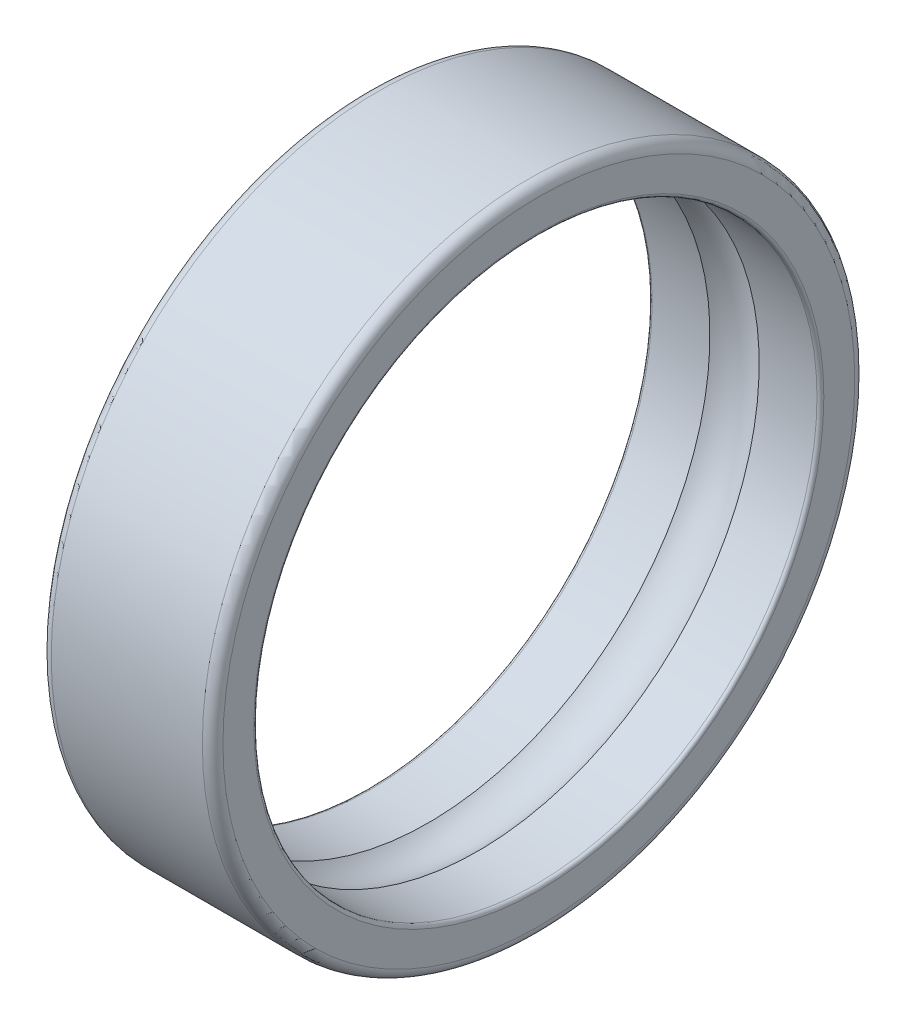
ISO-10303-21;
HEADER;
FILE_DESCRIPTION(('STEP AP214'),'2;1');
FILE_NAME('part.step','',(''),(''),'','','');
FILE_SCHEMA(('AUTOMOTIVE_DESIGN { 1 0 10303 214 1 1 1 1 }'));
ENDSEC;
DATA;
#1=APPLICATION_CONTEXT('core data for automotive mechanical design processes');
#2=APPLICATION_PROTOCOL_DEFINITION('international standard','automotive_design',2000,#1);
#3=PRODUCT_CONTEXT('',#1,'mechanical');
#4=PRODUCT('Part','Part','',(#3));
#5=PRODUCT_RELATED_PRODUCT_CATEGORY('part','',(#4));
#6=PRODUCT_DEFINITION_FORMATION('','',#4);
#7=PRODUCT_DEFINITION_CONTEXT('part definition',#1,'design');
#8=PRODUCT_DEFINITION('design','',#6,#7);
#9=PRODUCT_DEFINITION_SHAPE('','',#8);
#10=(LENGTH_UNIT() NAMED_UNIT(*) SI_UNIT(.MILLI.,.METRE.));
#11=(NAMED_UNIT(*) PLANE_ANGLE_UNIT() SI_UNIT($,.RADIAN.));
#12=(NAMED_UNIT(*) SI_UNIT($,.STERADIAN.) SOLID_ANGLE_UNIT());
#13=UNCERTAINTY_MEASURE_WITH_UNIT(LENGTH_MEASURE(1.E-05),#10,'distance_accuracy_value','');
#14=(GEOMETRIC_REPRESENTATION_CONTEXT(3) GLOBAL_UNCERTAINTY_ASSIGNED_CONTEXT((#13)) GLOBAL_UNIT_ASSIGNED_CONTEXT((#10,
#11,#12)) REPRESENTATION_CONTEXT('',''));
#15=CARTESIAN_POINT('',(0.,0.,0.));
#16=DIRECTION('',(0.,0.,1.));
#17=DIRECTION('',(1.,0.,0.));
#18=AXIS2_PLACEMENT_3D('',#15,#16,#17);
#19=CARTESIAN_POINT('',(0.,0.,0.));
#20=DIRECTION('',(1.,0.,0.));
#21=DIRECTION('',(0.,0.,-1.));
#22=AXIS2_PLACEMENT_3D('',#19,#20,#21);
#23=TOROIDAL_SURFACE('',#22,7.25,1.1905);
#24=CARTESIAN_POINT('',(0.717488850087582,0.,0.));
#25=DIRECTION('',(-1.,0.,0.));
#26=DIRECTION('',(0.,0.,1.));
#27=AXIS2_PLACEMENT_3D('',#24,#25,#26);
#28=CIRCLE('',#27,8.2);
#29=CARTESIAN_POINT('',(0.717488850087582,0.,8.2));
#30=VERTEX_POINT('',#29);
#31=EDGE_CURVE('E142',#30,#30,#28,.F.);
#32=ORIENTED_EDGE('',*,*,#31,.T.);
#33=EDGE_LOOP('',(#32));
#34=FACE_BOUND('',#33,.T.);
#35=CARTESIAN_POINT('',(-0.717488850087582,0.,0.));
#36=DIRECTION('',(-1.,0.,0.));
#37=DIRECTION('',(0.,0.,1.));
#38=AXIS2_PLACEMENT_3D('',#35,#36,#37);
#39=CIRCLE('',#38,8.2);
#40=CARTESIAN_POINT('',(-0.717488850087582,0.,8.2));
#41=VERTEX_POINT('',#40);
#42=EDGE_CURVE('E135',#41,#41,#39,.T.);
#43=ORIENTED_EDGE('',*,*,#42,.T.);
#44=EDGE_LOOP('',(#43));
#45=FACE_BOUND('',#44,.T.);
#46=ADVANCED_FACE('F14',(#34,#45),#23,.F.);
#47=CARTESIAN_POINT('',(2.5,0.,0.));
#48=DIRECTION('',(-1.,0.,0.));
#49=DIRECTION('',(0.,0.,1.));
#50=AXIS2_PLACEMENT_3D('',#47,#48,#49);
#51=CYLINDRICAL_SURFACE('',#50,8.2);
#52=ORIENTED_EDGE('',*,*,#31,.F.);
#53=EDGE_LOOP('',(#52));
#54=FACE_BOUND('',#53,.T.);
#55=CARTESIAN_POINT('',(2.4,0.,0.));
#56=DIRECTION('',(1.,0.,0.));
#57=DIRECTION('',(0.,0.,-1.));
#58=AXIS2_PLACEMENT_3D('',#55,#56,#57);
#59=CIRCLE('',#58,8.2);
#60=CARTESIAN_POINT('',(2.4,0.,-8.2));
#61=VERTEX_POINT('',#60);
#62=EDGE_CURVE('E107',#61,#61,#59,.F.);
#63=ORIENTED_EDGE('',*,*,#62,.F.);
#64=EDGE_LOOP('',(#63));
#65=FACE_BOUND('',#64,.T.);
#66=ADVANCED_FACE('F148',(#54,#65),#51,.F.);
#67=CARTESIAN_POINT('',(2.5,0.,0.));
#68=DIRECTION('',(-1.,0.,0.));
#69=DIRECTION('',(0.,0.,1.));
#70=AXIS2_PLACEMENT_3D('',#67,#68,#69);
#71=CYLINDRICAL_SURFACE('',#70,8.2);
#72=CARTESIAN_POINT('',(-2.4,0.,0.));
#73=DIRECTION('',(1.,0.,0.));
#74=DIRECTION('',(0.,0.,-1.));
#75=AXIS2_PLACEMENT_3D('',#72,#73,#74);
#76=CIRCLE('',#75,8.2);
#77=CARTESIAN_POINT('',(-2.4,0.,-8.2));
#78=VERTEX_POINT('',#77);
#79=EDGE_CURVE('E103',#78,#78,#76,.T.);
#80=ORIENTED_EDGE('',*,*,#79,.F.);
#81=EDGE_LOOP('',(#80));
#82=FACE_BOUND('',#81,.T.);
#83=ORIENTED_EDGE('',*,*,#42,.F.);
#84=EDGE_LOOP('',(#83));
#85=FACE_BOUND('',#84,.T.);
#86=ADVANCED_FACE('F128',(#82,#85),#71,.F.);
#87=CARTESIAN_POINT('',(2.4,0.,0.));
#88=DIRECTION('',(1.,0.,0.));
#89=DIRECTION('',(0.,0.,-1.));
#90=AXIS2_PLACEMENT_3D('',#87,#88,#89);
#91=TOROIDAL_SURFACE('',#90,8.30000000000001,0.100000000000005);
#92=ORIENTED_EDGE('',*,*,#62,.T.);
#93=EDGE_LOOP('',(#92));
#94=FACE_BOUND('',#93,.T.);
#95=CARTESIAN_POINT('',(2.5,0.,0.));
#96=DIRECTION('',(1.,0.,0.));
#97=DIRECTION('',(0.,0.,-1.));
#98=AXIS2_PLACEMENT_3D('',#95,#96,#97);
#99=CIRCLE('',#98,8.30000000000001);
#100=CARTESIAN_POINT('',(2.5,0.,-8.30000000000001));
#101=VERTEX_POINT('',#100);
#102=EDGE_CURVE('E106',#101,#101,#99,.F.);
#103=ORIENTED_EDGE('',*,*,#102,.F.);
#104=EDGE_LOOP('',(#103));
#105=FACE_BOUND('',#104,.T.);
#106=ADVANCED_FACE('F124',(#94,#105),#91,.T.);
#107=CARTESIAN_POINT('',(-2.4,0.,0.));
#108=DIRECTION('',(1.,0.,0.));
#109=DIRECTION('',(0.,0.,-1.));
#110=AXIS2_PLACEMENT_3D('',#107,#108,#109);
#111=TOROIDAL_SURFACE('',#110,8.30000000000001,0.100000000000003);
#112=CARTESIAN_POINT('',(-2.5,0.,0.));
#113=DIRECTION('',(-1.,0.,0.));
#114=DIRECTION('',(0.,0.,-1.));
#115=AXIS2_PLACEMENT_3D('',#112,#113,#114);
#116=CIRCLE('',#115,8.3);
#117=CARTESIAN_POINT('',(-2.5,0.,-8.3));
#118=VERTEX_POINT('',#117);
#119=EDGE_CURVE('E112',#118,#118,#116,.F.);
#120=ORIENTED_EDGE('',*,*,#119,.F.);
#121=EDGE_LOOP('',(#120));
#122=FACE_BOUND('',#121,.T.);
#123=ORIENTED_EDGE('',*,*,#79,.T.);
#124=EDGE_LOOP('',(#123));
#125=FACE_BOUND('',#124,.T.);
#126=ADVANCED_FACE('F77',(#122,#125),#111,.T.);
#127=CARTESIAN_POINT('',(2.5,8.3,0.));
#128=DIRECTION('',(1.,0.,0.));
#129=DIRECTION('',(0.,0.,-1.));
#130=AXIS2_PLACEMENT_3D('',#127,#128,#129);
#131=PLANE('',#130);
#132=ORIENTED_EDGE('',*,*,#102,.T.);
#133=EDGE_LOOP('',(#132));
#134=FACE_BOUND('',#133,.T.);
#135=CARTESIAN_POINT('',(2.5,0.,0.));
#136=DIRECTION('',(-1.,0.,0.));
#137=DIRECTION('',(0.,0.,-1.));
#138=AXIS2_PLACEMENT_3D('',#135,#136,#137);
#139=CIRCLE('',#138,9.2);
#140=CARTESIAN_POINT('',(2.5,0.,-9.2));
#141=VERTEX_POINT('',#140);
#142=EDGE_CURVE('E60',#141,#141,#139,.T.);
#143=ORIENTED_EDGE('',*,*,#142,.F.);
#144=EDGE_LOOP('',(#143));
#145=FACE_BOUND('',#144,.T.);
#146=ADVANCED_FACE('F67',(#134,#145),#131,.T.);
#147=CARTESIAN_POINT('',(-2.5,9.2,0.));
#148=DIRECTION('',(-1.,0.,0.));
#149=DIRECTION('',(0.,0.,1.));
#150=AXIS2_PLACEMENT_3D('',#147,#148,#149);
#151=PLANE('',#150);
#152=CARTESIAN_POINT('',(-2.5,0.,0.));
#153=DIRECTION('',(1.,0.,0.));
#154=DIRECTION('',(0.,0.,-1.));
#155=AXIS2_PLACEMENT_3D('',#152,#153,#154);
#156=CIRCLE('',#155,9.2);
#157=CARTESIAN_POINT('',(-2.5,0.,-9.2));
#158=VERTEX_POINT('',#157);
#159=EDGE_CURVE('E26',#158,#158,#156,.T.);
#160=ORIENTED_EDGE('',*,*,#159,.F.);
#161=EDGE_LOOP('',(#160));
#162=FACE_BOUND('',#161,.T.);
#163=ORIENTED_EDGE('',*,*,#119,.T.);
#164=EDGE_LOOP('',(#163));
#165=FACE_BOUND('',#164,.T.);
#166=ADVANCED_FACE('F76',(#162,#165),#151,.T.);
#167=CARTESIAN_POINT('',(2.2,0.,0.));
#168=DIRECTION('',(1.,0.,0.));
#169=DIRECTION('',(0.,0.,-1.));
#170=AXIS2_PLACEMENT_3D('',#167,#168,#169);
#171=TOROIDAL_SURFACE('',#170,9.2,0.300000000000003);
#172=ORIENTED_EDGE('',*,*,#142,.T.);
#173=EDGE_LOOP('',(#172));
#174=FACE_BOUND('',#173,.T.);
#175=CARTESIAN_POINT('',(2.2,0.,0.));
#176=DIRECTION('',(-1.,0.,0.));
#177=DIRECTION('',(0.,0.,1.));
#178=AXIS2_PLACEMENT_3D('',#175,#176,#177);
#179=CIRCLE('',#178,9.5);
#180=CARTESIAN_POINT('',(2.2,0.,9.5));
#181=VERTEX_POINT('',#180);
#182=EDGE_CURVE('E21',#181,#181,#179,.T.);
#183=ORIENTED_EDGE('',*,*,#182,.F.);
#184=EDGE_LOOP('',(#183));
#185=FACE_BOUND('',#184,.T.);
#186=ADVANCED_FACE('F40',(#174,#185),#171,.T.);
#187=CARTESIAN_POINT('',(-2.2,0.,0.));
#188=DIRECTION('',(1.,0.,0.));
#189=DIRECTION('',(0.,0.,-1.));
#190=AXIS2_PLACEMENT_3D('',#187,#188,#189);
#191=TOROIDAL_SURFACE('',#190,9.2,0.300000000000002);
#192=CARTESIAN_POINT('',(-2.2,0.,0.));
#193=DIRECTION('',(-1.,0.,0.));
#194=DIRECTION('',(0.,0.,1.));
#195=AXIS2_PLACEMENT_3D('',#192,#193,#194);
#196=CIRCLE('',#195,9.5);
#197=CARTESIAN_POINT('',(-2.2,0.,9.5));
#198=VERTEX_POINT('',#197);
#199=EDGE_CURVE('E9',#198,#198,#196,.F.);
#200=ORIENTED_EDGE('',*,*,#199,.F.);
#201=EDGE_LOOP('',(#200));
#202=FACE_BOUND('',#201,.T.);
#203=ORIENTED_EDGE('',*,*,#159,.T.);
#204=EDGE_LOOP('',(#203));
#205=FACE_BOUND('',#204,.T.);
#206=ADVANCED_FACE('F34',(#202,#205),#191,.T.);
#207=CARTESIAN_POINT('',(2.5,0.,0.));
#208=DIRECTION('',(-1.,0.,0.));
#209=DIRECTION('',(0.,0.,1.));
#210=AXIS2_PLACEMENT_3D('',#207,#208,#209);
#211=CYLINDRICAL_SURFACE('',#210,9.5);
#212=ORIENTED_EDGE('',*,*,#182,.T.);
#213=EDGE_LOOP('',(#212));
#214=FACE_BOUND('',#213,.T.);
#215=ORIENTED_EDGE('',*,*,#199,.T.);
#216=EDGE_LOOP('',(#215));
#217=FACE_BOUND('',#216,.T.);
#218=ADVANCED_FACE('F39',(#214,#217),#211,.T.);
#219=CLOSED_SHELL('',(#46,#66,#86,#106,#126,#146,#166,#186,#206,#218));
#220=MANIFOLD_SOLID_BREP('B1',#219);
#221=ADVANCED_BREP_SHAPE_REPRESENTATION('',(#18,#220),#14);
#222=SHAPE_DEFINITION_REPRESENTATION(#9,#221);
ENDSEC;
END-ISO-10303-21;
